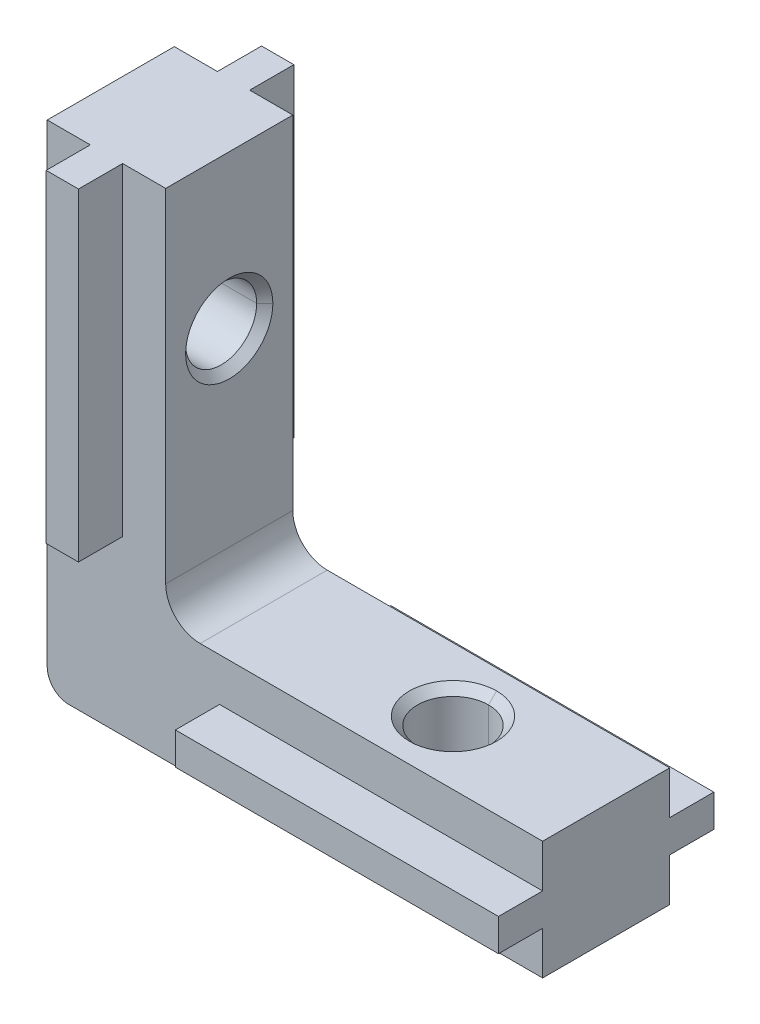
ISO-10303-21;
HEADER;
FILE_DESCRIPTION(('STEP AP214'),'2;1');
FILE_NAME('part.step','',(''),(''),'','','');
FILE_SCHEMA(('AUTOMOTIVE_DESIGN { 1 0 10303 214 1 1 1 1 }'));
ENDSEC;
DATA;
#1=APPLICATION_CONTEXT('core data for automotive mechanical design processes');
#2=APPLICATION_PROTOCOL_DEFINITION('international standard','automotive_design',2000,#1);
#3=PRODUCT_CONTEXT('',#1,'mechanical');
#4=PRODUCT('Part','Part','',(#3));
#5=PRODUCT_RELATED_PRODUCT_CATEGORY('part','',(#4));
#6=PRODUCT_DEFINITION_FORMATION('','',#4);
#7=PRODUCT_DEFINITION_CONTEXT('part definition',#1,'design');
#8=PRODUCT_DEFINITION('design','',#6,#7);
#9=PRODUCT_DEFINITION_SHAPE('','',#8);
#10=(LENGTH_UNIT() NAMED_UNIT(*) SI_UNIT(.MILLI.,.METRE.));
#11=(NAMED_UNIT(*) PLANE_ANGLE_UNIT() SI_UNIT($,.RADIAN.));
#12=(NAMED_UNIT(*) SI_UNIT($,.STERADIAN.) SOLID_ANGLE_UNIT());
#13=UNCERTAINTY_MEASURE_WITH_UNIT(LENGTH_MEASURE(1.E-05),#10,'distance_accuracy_value','');
#14=(GEOMETRIC_REPRESENTATION_CONTEXT(3) GLOBAL_UNCERTAINTY_ASSIGNED_CONTEXT((#13)) GLOBAL_UNIT_ASSIGNED_CONTEXT((#10,
#11,#12)) REPRESENTATION_CONTEXT('',''));
#15=CARTESIAN_POINT('',(0.,0.,0.));
#16=DIRECTION('',(0.,0.,1.));
#17=DIRECTION('',(1.,0.,0.));
#18=AXIS2_PLACEMENT_3D('',#15,#16,#17);
#19=CARTESIAN_POINT('',(15.8889482700318,5.49999999999994,0.));
#20=DIRECTION('',(0.,1.,0.));
#21=DIRECTION('',(0.,0.,1.));
#22=AXIS2_PLACEMENT_3D('',#19,#20,#21);
#23=CONICAL_SURFACE('',#22,2.025,0.785398163397446);
#24=CARTESIAN_POINT('',(15.8889482700318,5.12499999999994,0.));
#25=DIRECTION('',(0.,1.,0.));
#26=DIRECTION('',(0.,0.,1.));
#27=AXIS2_PLACEMENT_3D('',#24,#25,#26);
#28=CIRCLE('',#27,1.65);
#29=CARTESIAN_POINT('',(15.8889482700318,5.12499999999994,-1.65));
#30=VERTEX_POINT('',#29);
#31=CARTESIAN_POINT('',(15.8889482700318,5.12499999999994,1.65));
#32=VERTEX_POINT('',#31);
#33=EDGE_CURVE('E41',#30,#32,#28,.T.);
#34=ORIENTED_EDGE('',*,*,#33,.F.);
#35=DIRECTION('',(0.,0.707106781186549,-0.707106781186546));
#36=VECTOR('',#35,1.);
#37=CARTESIAN_POINT('',(15.8889482700318,5.49999999999994,-2.025));
#38=LINE('',#37,#36);
#39=CARTESIAN_POINT('',(15.8889482700318,5.49999999999994,-2.025));
#40=VERTEX_POINT('',#39);
#41=EDGE_CURVE('E11',#30,#40,#38,.T.);
#42=ORIENTED_EDGE('',*,*,#41,.T.);
#43=CARTESIAN_POINT('',(15.8889482700318,5.49999999999994,0.));
#44=DIRECTION('',(0.,1.,0.));
#45=DIRECTION('',(0.,0.,1.));
#46=AXIS2_PLACEMENT_3D('',#43,#44,#45);
#47=CIRCLE('',#46,2.025);
#48=CARTESIAN_POINT('',(15.8889482700318,5.49999999999994,2.025));
#49=VERTEX_POINT('',#48);
#50=EDGE_CURVE('E27',#40,#49,#47,.T.);
#51=ORIENTED_EDGE('',*,*,#50,.T.);
#52=DIRECTION('',(0.,0.707106781186549,0.707106781186546));
#53=VECTOR('',#52,1.);
#54=CARTESIAN_POINT('',(15.8889482700318,5.49999999999994,2.025));
#55=LINE('',#54,#53);
#56=EDGE_CURVE('E403',#32,#49,#55,.T.);
#57=ORIENTED_EDGE('',*,*,#56,.F.);
#58=EDGE_LOOP('',(#34,#42,#51,#57));
#59=FACE_BOUND('',#58,.T.);
#60=ADVANCED_FACE('F16',(#59),#23,.F.);
#61=CARTESIAN_POINT('',(15.8889482700318,5.49999999999994,0.));
#62=DIRECTION('',(0.,1.,0.));
#63=DIRECTION('',(0.,0.,1.));
#64=AXIS2_PLACEMENT_3D('',#61,#62,#63);
#65=CYLINDRICAL_SURFACE('',#64,1.65);
#66=CARTESIAN_POINT('',(15.8889482700318,0.,0.));
#67=DIRECTION('',(0.,1.,0.));
#68=DIRECTION('',(0.,0.,1.));
#69=AXIS2_PLACEMENT_3D('',#66,#67,#68);
#70=CIRCLE('',#69,1.65);
#71=CARTESIAN_POINT('',(15.8889482700318,0.,-1.65));
#72=VERTEX_POINT('',#71);
#73=CARTESIAN_POINT('',(15.8889482700318,0.,1.65));
#74=VERTEX_POINT('',#73);
#75=EDGE_CURVE('E507',#72,#74,#70,.T.);
#76=ORIENTED_EDGE('',*,*,#75,.F.);
#77=DIRECTION('',(0.,1.,0.));
#78=VECTOR('',#77,1.);
#79=CARTESIAN_POINT('',(15.8889482700318,5.49999999999994,-1.65));
#80=LINE('',#79,#78);
#81=EDGE_CURVE('E366',#72,#30,#80,.T.);
#82=ORIENTED_EDGE('',*,*,#81,.T.);
#83=ORIENTED_EDGE('',*,*,#33,.T.);
#84=DIRECTION('',(0.,1.,0.));
#85=VECTOR('',#84,1.);
#86=CARTESIAN_POINT('',(15.8889482700318,5.49999999999994,1.65));
#87=LINE('',#86,#85);
#88=EDGE_CURVE('E410',#74,#32,#87,.T.);
#89=ORIENTED_EDGE('',*,*,#88,.F.);
#90=EDGE_LOOP('',(#76,#82,#83,#89));
#91=FACE_BOUND('',#90,.T.);
#92=ADVANCED_FACE('F787',(#91),#65,.F.);
#93=CARTESIAN_POINT('',(5.5,15.8889482700318,0.));
#94=DIRECTION('',(1.,0.,0.));
#95=DIRECTION('',(0.,0.,-1.));
#96=AXIS2_PLACEMENT_3D('',#93,#94,#95);
#97=CONICAL_SURFACE('',#96,2.025,0.785398163397446);
#98=CARTESIAN_POINT('',(5.125,15.8889482700318,0.));
#99=DIRECTION('',(1.,0.,0.));
#100=DIRECTION('',(0.,0.,-1.));
#101=AXIS2_PLACEMENT_3D('',#98,#99,#100);
#102=CIRCLE('',#101,1.65);
#103=CARTESIAN_POINT('',(5.125,15.8889482700318,1.65));
#104=VERTEX_POINT('',#103);
#105=CARTESIAN_POINT('',(5.125,15.8889482700318,-1.65));
#106=VERTEX_POINT('',#105);
#107=EDGE_CURVE('E372',#104,#106,#102,.T.);
#108=ORIENTED_EDGE('',*,*,#107,.F.);
#109=DIRECTION('',(0.707106781186549,0.,0.707106781186546));
#110=VECTOR('',#109,1.);
#111=CARTESIAN_POINT('',(5.5,15.8889482700318,2.025));
#112=LINE('',#111,#110);
#113=CARTESIAN_POINT('',(5.5,15.8889482700318,2.025));
#114=VERTEX_POINT('',#113);
#115=EDGE_CURVE('E350',#104,#114,#112,.T.);
#116=ORIENTED_EDGE('',*,*,#115,.T.);
#117=CARTESIAN_POINT('',(5.5,15.8889482700318,0.));
#118=DIRECTION('',(1.,0.,0.));
#119=DIRECTION('',(0.,0.,-1.));
#120=AXIS2_PLACEMENT_3D('',#117,#118,#119);
#121=CIRCLE('',#120,2.025);
#122=CARTESIAN_POINT('',(5.5,15.8889482700318,-2.025));
#123=VERTEX_POINT('',#122);
#124=EDGE_CURVE('E346',#114,#123,#121,.T.);
#125=ORIENTED_EDGE('',*,*,#124,.T.);
#126=DIRECTION('',(0.707106781186549,0.,-0.707106781186546));
#127=VECTOR('',#126,1.);
#128=CARTESIAN_POINT('',(5.5,15.8889482700318,-2.025));
#129=LINE('',#128,#127);
#130=EDGE_CURVE('E515',#106,#123,#129,.T.);
#131=ORIENTED_EDGE('',*,*,#130,.F.);
#132=EDGE_LOOP('',(#108,#116,#125,#131));
#133=FACE_BOUND('',#132,.T.);
#134=ADVANCED_FACE('F792',(#133),#97,.F.);
#135=CARTESIAN_POINT('',(5.5,15.8889482700318,0.));
#136=DIRECTION('',(1.,0.,0.));
#137=DIRECTION('',(0.,0.,-1.));
#138=AXIS2_PLACEMENT_3D('',#135,#136,#137);
#139=CYLINDRICAL_SURFACE('',#138,1.65);
#140=CARTESIAN_POINT('',(0.,15.8889482700318,0.));
#141=DIRECTION('',(1.,0.,0.));
#142=DIRECTION('',(0.,0.,-1.));
#143=AXIS2_PLACEMENT_3D('',#140,#141,#142);
#144=CIRCLE('',#143,1.65);
#145=CARTESIAN_POINT('',(0.,15.8889482700318,1.65));
#146=VERTEX_POINT('',#145);
#147=CARTESIAN_POINT('',(0.,15.8889482700318,-1.65));
#148=VERTEX_POINT('',#147);
#149=EDGE_CURVE('E404',#146,#148,#144,.T.);
#150=ORIENTED_EDGE('',*,*,#149,.F.);
#151=DIRECTION('',(1.,0.,0.));
#152=VECTOR('',#151,1.);
#153=CARTESIAN_POINT('',(5.5,15.8889482700318,1.65));
#154=LINE('',#153,#152);
#155=EDGE_CURVE('E351',#146,#104,#154,.T.);
#156=ORIENTED_EDGE('',*,*,#155,.T.);
#157=ORIENTED_EDGE('',*,*,#107,.T.);
#158=DIRECTION('',(1.,0.,0.));
#159=VECTOR('',#158,1.);
#160=CARTESIAN_POINT('',(5.5,15.8889482700318,-1.65));
#161=LINE('',#160,#159);
#162=EDGE_CURVE('E333',#148,#106,#161,.T.);
#163=ORIENTED_EDGE('',*,*,#162,.F.);
#164=EDGE_LOOP('',(#150,#156,#157,#163));
#165=FACE_BOUND('',#164,.T.);
#166=ADVANCED_FACE('F822',(#165),#139,.F.);
#167=CARTESIAN_POINT('',(0.,0.,2.95));
#168=DIRECTION('',(0.,0.,1.));
#169=DIRECTION('',(1.,0.,0.));
#170=AXIS2_PLACEMENT_3D('',#167,#168,#169);
#171=PLANE('',#170);
#172=DIRECTION('',(0.,-1.,0.));
#173=VECTOR('',#172,1.);
#174=CARTESIAN_POINT('',(0.,23.,2.95));
#175=LINE('',#174,#173);
#176=CARTESIAN_POINT('',(0.,23.,2.95));
#177=VERTEX_POINT('',#176);
#178=CARTESIAN_POINT('',(0.,1.,2.95));
#179=VERTEX_POINT('',#178);
#180=EDGE_CURVE('E369',#177,#179,#175,.T.);
#181=ORIENTED_EDGE('',*,*,#180,.T.);
#182=CARTESIAN_POINT('',(1.,1.,2.95));
#183=DIRECTION('',(0.,0.,1.));
#184=DIRECTION('',(1.,0.,0.));
#185=AXIS2_PLACEMENT_3D('',#182,#183,#184);
#186=CIRCLE('',#185,1.);
#187=CARTESIAN_POINT('',(1.,0.,2.95));
#188=VERTEX_POINT('',#187);
#189=EDGE_CURVE('E373',#179,#188,#186,.T.);
#190=ORIENTED_EDGE('',*,*,#189,.T.);
#191=DIRECTION('',(1.,0.,0.));
#192=VECTOR('',#191,1.);
#193=CARTESIAN_POINT('',(0.,0.,2.95));
#194=LINE('',#193,#192);
#195=CARTESIAN_POINT('',(23.,0.,2.95));
#196=VERTEX_POINT('',#195);
#197=EDGE_CURVE('E429',#188,#196,#194,.T.);
#198=ORIENTED_EDGE('',*,*,#197,.T.);
#199=DIRECTION('',(0.,1.,0.));
#200=VECTOR('',#199,1.);
#201=CARTESIAN_POINT('',(23.,0.,2.95));
#202=LINE('',#201,#200);
#203=CARTESIAN_POINT('',(23.,1.99999999999992,2.95));
#204=VERTEX_POINT('',#203);
#205=EDGE_CURVE('E425',#196,#204,#202,.T.);
#206=ORIENTED_EDGE('',*,*,#205,.T.);
#207=DIRECTION('',(-1.,0.,0.));
#208=VECTOR('',#207,1.);
#209=CARTESIAN_POINT('',(0.,2.,2.95));
#210=LINE('',#209,#208);
#211=CARTESIAN_POINT('',(8.,1.99999999999997,2.95));
#212=VERTEX_POINT('',#211);
#213=EDGE_CURVE('E430',#204,#212,#210,.T.);
#214=ORIENTED_EDGE('',*,*,#213,.T.);
#215=DIRECTION('',(0.,1.,0.));
#216=VECTOR('',#215,1.);
#217=CARTESIAN_POINT('',(8.,0.,2.95));
#218=LINE('',#217,#216);
#219=CARTESIAN_POINT('',(8.,3.5,2.95));
#220=VERTEX_POINT('',#219);
#221=EDGE_CURVE('E496',#212,#220,#218,.T.);
#222=ORIENTED_EDGE('',*,*,#221,.T.);
#223=DIRECTION('',(1.,0.,0.));
#224=VECTOR('',#223,1.);
#225=CARTESIAN_POINT('',(0.,3.5,2.95));
#226=LINE('',#225,#224);
#227=CARTESIAN_POINT('',(23.,3.49999999999992,2.95));
#228=VERTEX_POINT('',#227);
#229=EDGE_CURVE('E326',#220,#228,#226,.T.);
#230=ORIENTED_EDGE('',*,*,#229,.T.);
#231=DIRECTION('',(0.,1.,0.));
#232=VECTOR('',#231,1.);
#233=CARTESIAN_POINT('',(23.,0.,2.95));
#234=LINE('',#233,#232);
#235=CARTESIAN_POINT('',(23.,5.5,2.95));
#236=VERTEX_POINT('',#235);
#237=EDGE_CURVE('E322',#228,#236,#234,.T.);
#238=ORIENTED_EDGE('',*,*,#237,.T.);
#239=DIRECTION('',(-1.,0.,0.));
#240=VECTOR('',#239,1.);
#241=CARTESIAN_POINT('',(23.,5.5,2.95));
#242=LINE('',#241,#240);
#243=CARTESIAN_POINT('',(7.1,5.5,2.95));
#244=VERTEX_POINT('',#243);
#245=EDGE_CURVE('E327',#236,#244,#242,.T.);
#246=ORIENTED_EDGE('',*,*,#245,.T.);
#247=CARTESIAN_POINT('',(7.1,7.1,2.95));
#248=DIRECTION('',(0.,0.,-1.));
#249=DIRECTION('',(1.,0.,0.));
#250=AXIS2_PLACEMENT_3D('',#247,#248,#249);
#251=CIRCLE('',#250,1.6);
#252=CARTESIAN_POINT('',(5.5,7.1,2.95));
#253=VERTEX_POINT('',#252);
#254=EDGE_CURVE('E458',#244,#253,#251,.T.);
#255=ORIENTED_EDGE('',*,*,#254,.T.);
#256=DIRECTION('',(0.,1.,0.));
#257=VECTOR('',#256,1.);
#258=CARTESIAN_POINT('',(5.5,5.5,2.95));
#259=LINE('',#258,#257);
#260=CARTESIAN_POINT('',(5.5,23.,2.95));
#261=VERTEX_POINT('',#260);
#262=EDGE_CURVE('E84',#253,#261,#259,.T.);
#263=ORIENTED_EDGE('',*,*,#262,.T.);
#264=DIRECTION('',(-1.,0.,0.));
#265=VECTOR('',#264,1.);
#266=CARTESIAN_POINT('',(5.5,23.,2.95));
#267=LINE('',#266,#265);
#268=CARTESIAN_POINT('',(3.5,23.,2.95));
#269=VERTEX_POINT('',#268);
#270=EDGE_CURVE('E101',#261,#269,#267,.T.);
#271=ORIENTED_EDGE('',*,*,#270,.T.);
#272=DIRECTION('',(0.,1.,0.));
#273=VECTOR('',#272,1.);
#274=CARTESIAN_POINT('',(3.5,0.,2.95));
#275=LINE('',#274,#273);
#276=CARTESIAN_POINT('',(3.5,8.,2.95));
#277=VERTEX_POINT('',#276);
#278=EDGE_CURVE('E468',#277,#269,#275,.T.);
#279=ORIENTED_EDGE('',*,*,#278,.F.);
#280=DIRECTION('',(-1.,0.,0.));
#281=VECTOR('',#280,1.);
#282=CARTESIAN_POINT('',(0.,8.,2.95));
#283=LINE('',#282,#281);
#284=CARTESIAN_POINT('',(2.,8.,2.95));
#285=VERTEX_POINT('',#284);
#286=EDGE_CURVE('E462',#277,#285,#283,.T.);
#287=ORIENTED_EDGE('',*,*,#286,.T.);
#288=DIRECTION('',(0.,-1.,0.));
#289=VECTOR('',#288,1.);
#290=CARTESIAN_POINT('',(2.,0.,2.95));
#291=LINE('',#290,#289);
#292=CARTESIAN_POINT('',(2.,23.,2.95));
#293=VERTEX_POINT('',#292);
#294=EDGE_CURVE('E321',#293,#285,#291,.T.);
#295=ORIENTED_EDGE('',*,*,#294,.F.);
#296=DIRECTION('',(-1.,0.,0.));
#297=VECTOR('',#296,1.);
#298=CARTESIAN_POINT('',(5.5,23.,2.95));
#299=LINE('',#298,#297);
#300=EDGE_CURVE('E459',#293,#177,#299,.T.);
#301=ORIENTED_EDGE('',*,*,#300,.T.);
#302=EDGE_LOOP('',(#181,#190,#198,#206,#214,#222,#230,#238,#246,#255,#263,#271,#279,#287,#295,#301));
#303=FACE_BOUND('',#302,.T.);
#304=ADVANCED_FACE('F619',(#303),#171,.T.);
#305=CARTESIAN_POINT('',(0.,0.,-2.95));
#306=DIRECTION('',(0.,0.,1.));
#307=DIRECTION('',(1.,0.,0.));
#308=AXIS2_PLACEMENT_3D('',#305,#306,#307);
#309=PLANE('',#308);
#310=DIRECTION('',(1.,0.,0.));
#311=VECTOR('',#310,1.);
#312=CARTESIAN_POINT('',(0.,0.,-2.95));
#313=LINE('',#312,#311);
#314=CARTESIAN_POINT('',(1.,0.,-2.95));
#315=VERTEX_POINT('',#314);
#316=CARTESIAN_POINT('',(23.,0.,-2.95));
#317=VERTEX_POINT('',#316);
#318=EDGE_CURVE('E437',#315,#317,#313,.T.);
#319=ORIENTED_EDGE('',*,*,#318,.F.);
#320=CARTESIAN_POINT('',(1.,1.,-2.95));
#321=DIRECTION('',(0.,0.,-1.));
#322=DIRECTION('',(1.,0.,0.));
#323=AXIS2_PLACEMENT_3D('',#320,#321,#322);
#324=CIRCLE('',#323,1.);
#325=CARTESIAN_POINT('',(0.,1.,-2.95));
#326=VERTEX_POINT('',#325);
#327=EDGE_CURVE('E463',#315,#326,#324,.T.);
#328=ORIENTED_EDGE('',*,*,#327,.T.);
#329=DIRECTION('',(0.,-1.,0.));
#330=VECTOR('',#329,1.);
#331=CARTESIAN_POINT('',(0.,23.,-2.95));
#332=LINE('',#331,#330);
#333=CARTESIAN_POINT('',(0.,23.,-2.95));
#334=VERTEX_POINT('',#333);
#335=EDGE_CURVE('E435',#334,#326,#332,.T.);
#336=ORIENTED_EDGE('',*,*,#335,.F.);
#337=DIRECTION('',(-1.,0.,0.));
#338=VECTOR('',#337,1.);
#339=CARTESIAN_POINT('',(5.5,23.,-2.95));
#340=LINE('',#339,#338);
#341=CARTESIAN_POINT('',(2.,23.,-2.95));
#342=VERTEX_POINT('',#341);
#343=EDGE_CURVE('E557',#342,#334,#340,.T.);
#344=ORIENTED_EDGE('',*,*,#343,.F.);
#345=DIRECTION('',(0.,-1.,0.));
#346=VECTOR('',#345,1.);
#347=CARTESIAN_POINT('',(2.,0.,-2.95));
#348=LINE('',#347,#346);
#349=CARTESIAN_POINT('',(2.,8.,-2.95));
#350=VERTEX_POINT('',#349);
#351=EDGE_CURVE('E285',#342,#350,#348,.T.);
#352=ORIENTED_EDGE('',*,*,#351,.T.);
#353=DIRECTION('',(-1.,0.,0.));
#354=VECTOR('',#353,1.);
#355=CARTESIAN_POINT('',(0.,8.,-2.95));
#356=LINE('',#355,#354);
#357=CARTESIAN_POINT('',(3.5,8.,-2.95));
#358=VERTEX_POINT('',#357);
#359=EDGE_CURVE('E277',#358,#350,#356,.T.);
#360=ORIENTED_EDGE('',*,*,#359,.F.);
#361=DIRECTION('',(0.,1.,0.));
#362=VECTOR('',#361,1.);
#363=CARTESIAN_POINT('',(3.5,0.,-2.95));
#364=LINE('',#363,#362);
#365=CARTESIAN_POINT('',(3.5,23.,-2.95));
#366=VERTEX_POINT('',#365);
#367=EDGE_CURVE('E282',#358,#366,#364,.T.);
#368=ORIENTED_EDGE('',*,*,#367,.T.);
#369=DIRECTION('',(-1.,0.,0.));
#370=VECTOR('',#369,1.);
#371=CARTESIAN_POINT('',(5.5,23.,-2.95));
#372=LINE('',#371,#370);
#373=CARTESIAN_POINT('',(5.5,23.,-2.95));
#374=VERTEX_POINT('',#373);
#375=EDGE_CURVE('E375',#374,#366,#372,.T.);
#376=ORIENTED_EDGE('',*,*,#375,.F.);
#377=DIRECTION('',(0.,1.,0.));
#378=VECTOR('',#377,1.);
#379=CARTESIAN_POINT('',(5.5,5.5,-2.95));
#380=LINE('',#379,#378);
#381=CARTESIAN_POINT('',(5.5,7.1,-2.95));
#382=VERTEX_POINT('',#381);
#383=EDGE_CURVE('E336',#382,#374,#380,.T.);
#384=ORIENTED_EDGE('',*,*,#383,.F.);
#385=CARTESIAN_POINT('',(7.1,7.1,-2.95));
#386=DIRECTION('',(0.,0.,1.));
#387=DIRECTION('',(1.,0.,0.));
#388=AXIS2_PLACEMENT_3D('',#385,#386,#387);
#389=CIRCLE('',#388,1.6);
#390=CARTESIAN_POINT('',(7.1,5.5,-2.95));
#391=VERTEX_POINT('',#390);
#392=EDGE_CURVE('E20',#382,#391,#389,.T.);
#393=ORIENTED_EDGE('',*,*,#392,.T.);
#394=DIRECTION('',(-1.,0.,0.));
#395=VECTOR('',#394,1.);
#396=CARTESIAN_POINT('',(23.,5.5,-2.95));
#397=LINE('',#396,#395);
#398=CARTESIAN_POINT('',(23.,5.5,-2.95));
#399=VERTEX_POINT('',#398);
#400=EDGE_CURVE('E135',#399,#391,#397,.T.);
#401=ORIENTED_EDGE('',*,*,#400,.F.);
#402=DIRECTION('',(0.,1.,0.));
#403=VECTOR('',#402,1.);
#404=CARTESIAN_POINT('',(23.,0.,-2.95));
#405=LINE('',#404,#403);
#406=CARTESIAN_POINT('',(23.,3.49999999999992,-2.95));
#407=VERTEX_POINT('',#406);
#408=EDGE_CURVE('E504',#407,#399,#405,.T.);
#409=ORIENTED_EDGE('',*,*,#408,.F.);
#410=DIRECTION('',(1.,0.,0.));
#411=VECTOR('',#410,1.);
#412=CARTESIAN_POINT('',(0.,3.5,-2.95));
#413=LINE('',#412,#411);
#414=CARTESIAN_POINT('',(8.,3.5,-2.95));
#415=VERTEX_POINT('',#414);
#416=EDGE_CURVE('E122',#415,#407,#413,.T.);
#417=ORIENTED_EDGE('',*,*,#416,.F.);
#418=DIRECTION('',(0.,1.,0.));
#419=VECTOR('',#418,1.);
#420=CARTESIAN_POINT('',(8.,0.,-2.95));
#421=LINE('',#420,#419);
#422=CARTESIAN_POINT('',(8.,1.99999999999997,-2.95));
#423=VERTEX_POINT('',#422);
#424=EDGE_CURVE('E357',#423,#415,#421,.T.);
#425=ORIENTED_EDGE('',*,*,#424,.F.);
#426=DIRECTION('',(-1.,0.,0.));
#427=VECTOR('',#426,1.);
#428=CARTESIAN_POINT('',(0.,2.,-2.95));
#429=LINE('',#428,#427);
#430=CARTESIAN_POINT('',(23.,1.99999999999992,-2.95));
#431=VERTEX_POINT('',#430);
#432=EDGE_CURVE('E446',#431,#423,#429,.T.);
#433=ORIENTED_EDGE('',*,*,#432,.F.);
#434=DIRECTION('',(0.,1.,0.));
#435=VECTOR('',#434,1.);
#436=CARTESIAN_POINT('',(23.,0.,-2.95));
#437=LINE('',#436,#435);
#438=EDGE_CURVE('E424',#317,#431,#437,.T.);
#439=ORIENTED_EDGE('',*,*,#438,.F.);
#440=EDGE_LOOP('',(#319,#328,#336,#344,#352,#360,#368,#376,#384,#393,#401,#409,#417,#425,#433,#439));
#441=FACE_BOUND('',#440,.T.);
#442=ADVANCED_FACE('F280',(#441),#309,.F.);
#443=CARTESIAN_POINT('',(5.5,23.,2.95));
#444=DIRECTION('',(0.,-1.,0.));
#445=DIRECTION('',(0.,0.,-1.));
#446=AXIS2_PLACEMENT_3D('',#443,#444,#445);
#447=PLANE('',#446);
#448=ORIENTED_EDGE('',*,*,#375,.T.);
#449=DIRECTION('',(0.,0.,-1.));
#450=VECTOR('',#449,1.);
#451=CARTESIAN_POINT('',(3.5,23.,5.));
#452=LINE('',#451,#450);
#453=CARTESIAN_POINT('',(3.5,23.,-5.));
#454=VERTEX_POINT('',#453);
#455=EDGE_CURVE('E299',#366,#454,#452,.T.);
#456=ORIENTED_EDGE('',*,*,#455,.T.);
#457=DIRECTION('',(-1.,0.,0.));
#458=VECTOR('',#457,1.);
#459=CARTESIAN_POINT('',(3.5,23.,-5.));
#460=LINE('',#459,#458);
#461=CARTESIAN_POINT('',(2.,23.,-5.));
#462=VERTEX_POINT('',#461);
#463=EDGE_CURVE('E485',#454,#462,#460,.T.);
#464=ORIENTED_EDGE('',*,*,#463,.T.);
#465=DIRECTION('',(0.,0.,1.));
#466=VECTOR('',#465,1.);
#467=CARTESIAN_POINT('',(2.,23.,5.));
#468=LINE('',#467,#466);
#469=EDGE_CURVE('E553',#462,#342,#468,.T.);
#470=ORIENTED_EDGE('',*,*,#469,.T.);
#471=ORIENTED_EDGE('',*,*,#343,.T.);
#472=DIRECTION('',(0.,0.,-1.));
#473=VECTOR('',#472,1.);
#474=CARTESIAN_POINT('',(0.,23.,2.95));
#475=LINE('',#474,#473);
#476=EDGE_CURVE('E436',#177,#334,#475,.T.);
#477=ORIENTED_EDGE('',*,*,#476,.F.);
#478=ORIENTED_EDGE('',*,*,#300,.F.);
#479=DIRECTION('',(0.,0.,1.));
#480=VECTOR('',#479,1.);
#481=CARTESIAN_POINT('',(2.,23.,5.));
#482=LINE('',#481,#480);
#483=CARTESIAN_POINT('',(2.,23.,5.));
#484=VERTEX_POINT('',#483);
#485=EDGE_CURVE('E397',#293,#484,#482,.T.);
#486=ORIENTED_EDGE('',*,*,#485,.T.);
#487=DIRECTION('',(1.,0.,0.));
#488=VECTOR('',#487,1.);
#489=CARTESIAN_POINT('',(3.5,23.,5.));
#490=LINE('',#489,#488);
#491=CARTESIAN_POINT('',(3.5,23.,5.));
#492=VERTEX_POINT('',#491);
#493=EDGE_CURVE('E393',#484,#492,#490,.T.);
#494=ORIENTED_EDGE('',*,*,#493,.T.);
#495=DIRECTION('',(0.,0.,-1.));
#496=VECTOR('',#495,1.);
#497=CARTESIAN_POINT('',(3.5,23.,5.));
#498=LINE('',#497,#496);
#499=EDGE_CURVE('E398',#492,#269,#498,.T.);
#500=ORIENTED_EDGE('',*,*,#499,.T.);
#501=ORIENTED_EDGE('',*,*,#270,.F.);
#502=DIRECTION('',(0.,0.,-1.));
#503=VECTOR('',#502,1.);
#504=CARTESIAN_POINT('',(5.5,23.,2.95));
#505=LINE('',#504,#503);
#506=EDGE_CURVE('E418',#261,#374,#505,.T.);
#507=ORIENTED_EDGE('',*,*,#506,.T.);
#508=EDGE_LOOP('',(#448,#456,#464,#470,#471,#477,#478,#486,#494,#500,#501,#507));
#509=FACE_BOUND('',#508,.T.);
#510=ADVANCED_FACE('F620',(#509),#447,.F.);
#511=CARTESIAN_POINT('',(0.,23.,2.95));
#512=DIRECTION('',(1.,0.,0.));
#513=DIRECTION('',(0.,1.,0.));
#514=AXIS2_PLACEMENT_3D('',#511,#512,#513);
#515=PLANE('',#514);
#516=ORIENTED_EDGE('',*,*,#335,.T.);
#517=DIRECTION('',(0.,0.,1.));
#518=VECTOR('',#517,1.);
#519=CARTESIAN_POINT('',(0.,1.,2.95));
#520=LINE('',#519,#518);
#521=EDGE_CURVE('E431',#326,#179,#520,.T.);
#522=ORIENTED_EDGE('',*,*,#521,.T.);
#523=ORIENTED_EDGE('',*,*,#180,.F.);
#524=ORIENTED_EDGE('',*,*,#476,.T.);
#525=EDGE_LOOP('',(#516,#522,#523,#524));
#526=FACE_BOUND('',#525,.T.);
#527=CARTESIAN_POINT('',(0.,15.8889482700318,0.));
#528=DIRECTION('',(1.,0.,0.));
#529=DIRECTION('',(0.,0.,-1.));
#530=AXIS2_PLACEMENT_3D('',#527,#528,#529);
#531=CIRCLE('',#530,1.65);
#532=EDGE_CURVE('E408',#148,#146,#531,.T.);
#533=ORIENTED_EDGE('',*,*,#532,.T.);
#534=ORIENTED_EDGE('',*,*,#149,.T.);
#535=EDGE_LOOP('',(#533,#534));
#536=FACE_BOUND('',#535,.T.);
#537=ADVANCED_FACE('F859',(#526,#536),#515,.F.);
#538=CARTESIAN_POINT('',(0.,0.,2.95));
#539=DIRECTION('',(0.,1.,0.));
#540=DIRECTION('',(1.,0.,0.));
#541=AXIS2_PLACEMENT_3D('',#538,#539,#540);
#542=PLANE('',#541);
#543=ORIENTED_EDGE('',*,*,#197,.F.);
#544=DIRECTION('',(0.,0.,-1.));
#545=VECTOR('',#544,1.);
#546=CARTESIAN_POINT('',(1.,0.,2.95));
#547=LINE('',#546,#545);
#548=EDGE_CURVE('E409',#188,#315,#547,.T.);
#549=ORIENTED_EDGE('',*,*,#548,.T.);
#550=ORIENTED_EDGE('',*,*,#318,.T.);
#551=DIRECTION('',(0.,0.,-1.));
#552=VECTOR('',#551,1.);
#553=CARTESIAN_POINT('',(23.,0.,2.95));
#554=LINE('',#553,#552);
#555=EDGE_CURVE('E508',#196,#317,#554,.T.);
#556=ORIENTED_EDGE('',*,*,#555,.F.);
#557=EDGE_LOOP('',(#543,#549,#550,#556));
#558=FACE_BOUND('',#557,.T.);
#559=CARTESIAN_POINT('',(15.8889482700318,0.,0.));
#560=DIRECTION('',(0.,1.,0.));
#561=DIRECTION('',(0.,0.,1.));
#562=AXIS2_PLACEMENT_3D('',#559,#560,#561);
#563=CIRCLE('',#562,1.65);
#564=EDGE_CURVE('E440',#74,#72,#563,.T.);
#565=ORIENTED_EDGE('',*,*,#564,.T.);
#566=ORIENTED_EDGE('',*,*,#75,.T.);
#567=EDGE_LOOP('',(#565,#566));
#568=FACE_BOUND('',#567,.T.);
#569=ADVANCED_FACE('F854',(#558,#568),#542,.F.);
#570=CARTESIAN_POINT('',(23.,0.,2.95));
#571=DIRECTION('',(-1.,0.,0.));
#572=DIRECTION('',(0.,0.,1.));
#573=AXIS2_PLACEMENT_3D('',#570,#571,#572);
#574=PLANE('',#573);
#575=DIRECTION('',(0.,0.,-1.));
#576=VECTOR('',#575,1.);
#577=CARTESIAN_POINT('',(23.,3.49999999999992,5.));
#578=LINE('',#577,#576);
#579=CARTESIAN_POINT('',(23.,3.49999999999992,-5.));
#580=VERTEX_POINT('',#579);
#581=EDGE_CURVE('E381',#407,#580,#578,.T.);
#582=ORIENTED_EDGE('',*,*,#581,.F.);
#583=ORIENTED_EDGE('',*,*,#408,.T.);
#584=DIRECTION('',(0.,0.,-1.));
#585=VECTOR('',#584,1.);
#586=CARTESIAN_POINT('',(23.,5.5,2.95));
#587=LINE('',#586,#585);
#588=EDGE_CURVE('E352',#236,#399,#587,.T.);
#589=ORIENTED_EDGE('',*,*,#588,.F.);
#590=ORIENTED_EDGE('',*,*,#237,.F.);
#591=DIRECTION('',(0.,0.,-1.));
#592=VECTOR('',#591,1.);
#593=CARTESIAN_POINT('',(23.,3.49999999999992,5.));
#594=LINE('',#593,#592);
#595=CARTESIAN_POINT('',(23.,3.49999999999992,5.));
#596=VERTEX_POINT('',#595);
#597=EDGE_CURVE('E340',#596,#228,#594,.T.);
#598=ORIENTED_EDGE('',*,*,#597,.F.);
#599=DIRECTION('',(0.,1.,0.));
#600=VECTOR('',#599,1.);
#601=CARTESIAN_POINT('',(23.,3.49999999999992,5.));
#602=LINE('',#601,#600);
#603=CARTESIAN_POINT('',(23.,1.99999999999992,5.));
#604=VERTEX_POINT('',#603);
#605=EDGE_CURVE('E471',#604,#596,#602,.T.);
#606=ORIENTED_EDGE('',*,*,#605,.F.);
#607=DIRECTION('',(0.,0.,1.));
#608=VECTOR('',#607,1.);
#609=CARTESIAN_POINT('',(23.,1.99999999999992,5.));
#610=LINE('',#609,#608);
#611=EDGE_CURVE('E475',#204,#604,#610,.T.);
#612=ORIENTED_EDGE('',*,*,#611,.F.);
#613=ORIENTED_EDGE('',*,*,#205,.F.);
#614=ORIENTED_EDGE('',*,*,#555,.T.);
#615=ORIENTED_EDGE('',*,*,#438,.T.);
#616=DIRECTION('',(0.,0.,1.));
#617=VECTOR('',#616,1.);
#618=CARTESIAN_POINT('',(23.,1.99999999999992,5.));
#619=LINE('',#618,#617);
#620=CARTESIAN_POINT('',(23.,1.99999999999992,-5.));
#621=VERTEX_POINT('',#620);
#622=EDGE_CURVE('E442',#621,#431,#619,.T.);
#623=ORIENTED_EDGE('',*,*,#622,.F.);
#624=DIRECTION('',(0.,-1.,0.));
#625=VECTOR('',#624,1.);
#626=CARTESIAN_POINT('',(23.,3.49999999999992,-5.));
#627=LINE('',#626,#625);
#628=EDGE_CURVE('E450',#580,#621,#627,.T.);
#629=ORIENTED_EDGE('',*,*,#628,.F.);
#630=EDGE_LOOP('',(#582,#583,#589,#590,#598,#606,#612,#613,#614,#615,#623,#629));
#631=FACE_BOUND('',#630,.T.);
#632=ADVANCED_FACE('F658',(#631),#574,.F.);
#633=CARTESIAN_POINT('',(23.,5.5,2.95));
#634=DIRECTION('',(0.,-1.,0.));
#635=DIRECTION('',(0.,0.,-1.));
#636=AXIS2_PLACEMENT_3D('',#633,#634,#635);
#637=PLANE('',#636);
#638=ORIENTED_EDGE('',*,*,#400,.T.);
#639=DIRECTION('',(0.,0.,1.));
#640=VECTOR('',#639,1.);
#641=CARTESIAN_POINT('',(7.1,5.5,2.95));
#642=LINE('',#641,#640);
#643=EDGE_CURVE('E317',#391,#244,#642,.T.);
#644=ORIENTED_EDGE('',*,*,#643,.T.);
#645=ORIENTED_EDGE('',*,*,#245,.F.);
#646=ORIENTED_EDGE('',*,*,#588,.T.);
#647=EDGE_LOOP('',(#638,#644,#645,#646));
#648=FACE_BOUND('',#647,.T.);
#649=CARTESIAN_POINT('',(15.8889482700318,5.49999999999994,0.));
#650=DIRECTION('',(0.,1.,0.));
#651=DIRECTION('',(0.,0.,1.));
#652=AXIS2_PLACEMENT_3D('',#649,#650,#651);
#653=CIRCLE('',#652,2.025);
#654=EDGE_CURVE('E399',#49,#40,#653,.T.);
#655=ORIENTED_EDGE('',*,*,#654,.F.);
#656=ORIENTED_EDGE('',*,*,#50,.F.);
#657=EDGE_LOOP('',(#655,#656));
#658=FACE_BOUND('',#657,.T.);
#659=ADVANCED_FACE('F1049',(#648,#658),#637,.F.);
#660=CARTESIAN_POINT('',(5.5,5.5,2.95));
#661=DIRECTION('',(-1.,0.,0.));
#662=DIRECTION('',(0.,0.,1.));
#663=AXIS2_PLACEMENT_3D('',#660,#661,#662);
#664=PLANE('',#663);
#665=ORIENTED_EDGE('',*,*,#262,.F.);
#666=DIRECTION('',(0.,0.,-1.));
#667=VECTOR('',#666,1.);
#668=CARTESIAN_POINT('',(5.5,7.1,-2.95));
#669=LINE('',#668,#667);
#670=EDGE_CURVE('E356',#253,#382,#669,.T.);
#671=ORIENTED_EDGE('',*,*,#670,.T.);
#672=ORIENTED_EDGE('',*,*,#383,.T.);
#673=ORIENTED_EDGE('',*,*,#506,.F.);
#674=EDGE_LOOP('',(#665,#671,#672,#673));
#675=FACE_BOUND('',#674,.T.);
#676=CARTESIAN_POINT('',(5.5,15.8889482700318,0.));
#677=DIRECTION('',(1.,0.,0.));
#678=DIRECTION('',(0.,0.,-1.));
#679=AXIS2_PLACEMENT_3D('',#676,#677,#678);
#680=CIRCLE('',#679,2.025);
#681=EDGE_CURVE('E454',#123,#114,#680,.T.);
#682=ORIENTED_EDGE('',*,*,#681,.F.);
#683=ORIENTED_EDGE('',*,*,#124,.F.);
#684=EDGE_LOOP('',(#682,#683));
#685=FACE_BOUND('',#684,.T.);
#686=ADVANCED_FACE('F1044',(#675,#685),#664,.F.);
#687=CARTESIAN_POINT('',(3.5,8.,-5.));
#688=DIRECTION('',(0.,0.,-1.));
#689=DIRECTION('',(-1.,0.,0.));
#690=AXIS2_PLACEMENT_3D('',#687,#688,#689);
#691=PLANE('',#690);
#692=ORIENTED_EDGE('',*,*,#463,.F.);
#693=DIRECTION('',(0.,1.,0.));
#694=VECTOR('',#693,1.);
#695=CARTESIAN_POINT('',(3.5,8.,-5.));
#696=LINE('',#695,#694);
#697=CARTESIAN_POINT('',(3.5,8.,-5.));
#698=VERTEX_POINT('',#697);
#699=EDGE_CURVE('E307',#698,#454,#696,.T.);
#700=ORIENTED_EDGE('',*,*,#699,.F.);
#701=DIRECTION('',(-1.,0.,0.));
#702=VECTOR('',#701,1.);
#703=CARTESIAN_POINT('',(3.5,8.,-5.));
#704=LINE('',#703,#702);
#705=CARTESIAN_POINT('',(2.,8.,-5.));
#706=VERTEX_POINT('',#705);
#707=EDGE_CURVE('E305',#698,#706,#704,.T.);
#708=ORIENTED_EDGE('',*,*,#707,.T.);
#709=DIRECTION('',(0.,1.,0.));
#710=VECTOR('',#709,1.);
#711=CARTESIAN_POINT('',(2.,8.,-5.));
#712=LINE('',#711,#710);
#713=EDGE_CURVE('E291',#706,#462,#712,.T.);
#714=ORIENTED_EDGE('',*,*,#713,.T.);
#715=EDGE_LOOP('',(#692,#700,#708,#714));
#716=FACE_BOUND('',#715,.T.);
#717=ADVANCED_FACE('F930',(#716),#691,.T.);
#718=CARTESIAN_POINT('',(0.,8.,0.));
#719=DIRECTION('',(0.,1.,0.));
#720=DIRECTION('',(1.,0.,0.));
#721=AXIS2_PLACEMENT_3D('',#718,#719,#720);
#722=PLANE('',#721);
#723=DIRECTION('',(0.,0.,-1.));
#724=VECTOR('',#723,1.);
#725=CARTESIAN_POINT('',(3.5,8.,5.));
#726=LINE('',#725,#724);
#727=EDGE_CURVE('E292',#358,#698,#726,.T.);
#728=ORIENTED_EDGE('',*,*,#727,.F.);
#729=ORIENTED_EDGE('',*,*,#359,.T.);
#730=DIRECTION('',(0.,0.,1.));
#731=VECTOR('',#730,1.);
#732=CARTESIAN_POINT('',(2.,8.,5.));
#733=LINE('',#732,#731);
#734=EDGE_CURVE('E313',#706,#350,#733,.T.);
#735=ORIENTED_EDGE('',*,*,#734,.F.);
#736=ORIENTED_EDGE('',*,*,#707,.F.);
#737=EDGE_LOOP('',(#728,#729,#735,#736));
#738=FACE_BOUND('',#737,.T.);
#739=ADVANCED_FACE('F303',(#738),#722,.F.);
#740=CARTESIAN_POINT('',(3.5,8.,5.));
#741=DIRECTION('',(1.,0.,0.));
#742=DIRECTION('',(0.,1.,0.));
#743=AXIS2_PLACEMENT_3D('',#740,#741,#742);
#744=PLANE('',#743);
#745=ORIENTED_EDGE('',*,*,#367,.F.);
#746=ORIENTED_EDGE('',*,*,#727,.T.);
#747=ORIENTED_EDGE('',*,*,#699,.T.);
#748=ORIENTED_EDGE('',*,*,#455,.F.);
#749=EDGE_LOOP('',(#745,#746,#747,#748));
#750=FACE_BOUND('',#749,.T.);
#751=ADVANCED_FACE('F296',(#750),#744,.T.);
#752=CARTESIAN_POINT('',(2.,8.,5.));
#753=DIRECTION('',(-1.,0.,0.));
#754=DIRECTION('',(0.,0.,1.));
#755=AXIS2_PLACEMENT_3D('',#752,#753,#754);
#756=PLANE('',#755);
#757=ORIENTED_EDGE('',*,*,#351,.F.);
#758=ORIENTED_EDGE('',*,*,#469,.F.);
#759=ORIENTED_EDGE('',*,*,#713,.F.);
#760=ORIENTED_EDGE('',*,*,#734,.T.);
#761=EDGE_LOOP('',(#757,#758,#759,#760));
#762=FACE_BOUND('',#761,.T.);
#763=ADVANCED_FACE('F808',(#762),#756,.T.);
#764=CARTESIAN_POINT('',(2.,8.,5.));
#765=DIRECTION('',(-1.,0.,0.));
#766=DIRECTION('',(0.,0.,1.));
#767=AXIS2_PLACEMENT_3D('',#764,#765,#766);
#768=PLANE('',#767);
#769=ORIENTED_EDGE('',*,*,#485,.F.);
#770=ORIENTED_EDGE('',*,*,#294,.T.);
#771=DIRECTION('',(0.,0.,1.));
#772=VECTOR('',#771,1.);
#773=CARTESIAN_POINT('',(2.,8.,5.));
#774=LINE('',#773,#772);
#775=CARTESIAN_POINT('',(2.,8.,5.));
#776=VERTEX_POINT('',#775);
#777=EDGE_CURVE('E385',#285,#776,#774,.T.);
#778=ORIENTED_EDGE('',*,*,#777,.T.);
#779=DIRECTION('',(0.,1.,0.));
#780=VECTOR('',#779,1.);
#781=CARTESIAN_POINT('',(2.,8.,5.));
#782=LINE('',#781,#780);
#783=EDGE_CURVE('E392',#776,#484,#782,.T.);
#784=ORIENTED_EDGE('',*,*,#783,.T.);
#785=EDGE_LOOP('',(#769,#770,#778,#784));
#786=FACE_BOUND('',#785,.T.);
#787=ADVANCED_FACE('F803',(#786),#768,.T.);
#788=CARTESIAN_POINT('',(3.5,8.,5.));
#789=DIRECTION('',(1.,0.,0.));
#790=DIRECTION('',(0.,1.,0.));
#791=AXIS2_PLACEMENT_3D('',#788,#789,#790);
#792=PLANE('',#791);
#793=DIRECTION('',(0.,0.,-1.));
#794=VECTOR('',#793,1.);
#795=CARTESIAN_POINT('',(3.5,8.,5.));
#796=LINE('',#795,#794);
#797=CARTESIAN_POINT('',(3.5,8.,5.));
#798=VERTEX_POINT('',#797);
#799=EDGE_CURVE('E464',#798,#277,#796,.T.);
#800=ORIENTED_EDGE('',*,*,#799,.T.);
#801=ORIENTED_EDGE('',*,*,#278,.T.);
#802=ORIENTED_EDGE('',*,*,#499,.F.);
#803=DIRECTION('',(0.,1.,0.));
#804=VECTOR('',#803,1.);
#805=CARTESIAN_POINT('',(3.5,8.,5.));
#806=LINE('',#805,#804);
#807=EDGE_CURVE('E328',#798,#492,#806,.T.);
#808=ORIENTED_EDGE('',*,*,#807,.F.);
#809=EDGE_LOOP('',(#800,#801,#802,#808));
#810=FACE_BOUND('',#809,.T.);
#811=ADVANCED_FACE('F614',(#810),#792,.T.);
#812=CARTESIAN_POINT('',(3.5,8.,5.));
#813=DIRECTION('',(0.,0.,1.));
#814=DIRECTION('',(1.,0.,0.));
#815=AXIS2_PLACEMENT_3D('',#812,#813,#814);
#816=PLANE('',#815);
#817=ORIENTED_EDGE('',*,*,#493,.F.);
#818=ORIENTED_EDGE('',*,*,#783,.F.);
#819=DIRECTION('',(1.,0.,0.));
#820=VECTOR('',#819,1.);
#821=CARTESIAN_POINT('',(3.5,8.,5.));
#822=LINE('',#821,#820);
#823=EDGE_CURVE('E332',#776,#798,#822,.T.);
#824=ORIENTED_EDGE('',*,*,#823,.T.);
#825=ORIENTED_EDGE('',*,*,#807,.T.);
#826=EDGE_LOOP('',(#817,#818,#824,#825));
#827=FACE_BOUND('',#826,.T.);
#828=ADVANCED_FACE('F624',(#827),#816,.T.);
#829=CARTESIAN_POINT('',(0.,8.,0.));
#830=DIRECTION('',(0.,1.,0.));
#831=DIRECTION('',(1.,0.,0.));
#832=AXIS2_PLACEMENT_3D('',#829,#830,#831);
#833=PLANE('',#832);
#834=ORIENTED_EDGE('',*,*,#286,.F.);
#835=ORIENTED_EDGE('',*,*,#799,.F.);
#836=ORIENTED_EDGE('',*,*,#823,.F.);
#837=ORIENTED_EDGE('',*,*,#777,.F.);
#838=EDGE_LOOP('',(#834,#835,#836,#837));
#839=FACE_BOUND('',#838,.T.);
#840=ADVANCED_FACE('F627',(#839),#833,.F.);
#841=CARTESIAN_POINT('',(5.5,15.8889482700318,0.));
#842=DIRECTION('',(1.,0.,0.));
#843=DIRECTION('',(0.,0.,-1.));
#844=AXIS2_PLACEMENT_3D('',#841,#842,#843);
#845=CYLINDRICAL_SURFACE('',#844,1.65);
#846=ORIENTED_EDGE('',*,*,#155,.F.);
#847=ORIENTED_EDGE('',*,*,#532,.F.);
#848=ORIENTED_EDGE('',*,*,#162,.T.);
#849=CARTESIAN_POINT('',(5.125,15.8889482700318,0.));
#850=DIRECTION('',(1.,0.,0.));
#851=DIRECTION('',(0.,0.,-1.));
#852=AXIS2_PLACEMENT_3D('',#849,#850,#851);
#853=CIRCLE('',#852,1.65);
#854=EDGE_CURVE('E492',#106,#104,#853,.T.);
#855=ORIENTED_EDGE('',*,*,#854,.T.);
#856=EDGE_LOOP('',(#846,#847,#848,#855));
#857=FACE_BOUND('',#856,.T.);
#858=ADVANCED_FACE('F912',(#857),#845,.F.);
#859=CARTESIAN_POINT('',(5.5,15.8889482700318,0.));
#860=DIRECTION('',(1.,0.,0.));
#861=DIRECTION('',(0.,0.,-1.));
#862=AXIS2_PLACEMENT_3D('',#859,#860,#861);
#863=CONICAL_SURFACE('',#862,2.025,0.785398163397446);
#864=ORIENTED_EDGE('',*,*,#115,.F.);
#865=ORIENTED_EDGE('',*,*,#854,.F.);
#866=ORIENTED_EDGE('',*,*,#130,.T.);
#867=ORIENTED_EDGE('',*,*,#681,.T.);
#868=EDGE_LOOP('',(#864,#865,#866,#867));
#869=FACE_BOUND('',#868,.T.);
#870=ADVANCED_FACE('F18',(#869),#863,.F.);
#871=CARTESIAN_POINT('',(8.,3.5,-5.));
#872=DIRECTION('',(0.,0.,1.));
#873=DIRECTION('',(1.,0.,0.));
#874=AXIS2_PLACEMENT_3D('',#871,#872,#873);
#875=PLANE('',#874);
#876=ORIENTED_EDGE('',*,*,#628,.T.);
#877=DIRECTION('',(1.,0.,0.));
#878=VECTOR('',#877,1.);
#879=CARTESIAN_POINT('',(8.,1.99999999999997,-5.));
#880=LINE('',#879,#878);
#881=CARTESIAN_POINT('',(8.,1.99999999999997,-5.));
#882=VERTEX_POINT('',#881);
#883=EDGE_CURVE('E449',#882,#621,#880,.T.);
#884=ORIENTED_EDGE('',*,*,#883,.F.);
#885=DIRECTION('',(0.,-1.,0.));
#886=VECTOR('',#885,1.);
#887=CARTESIAN_POINT('',(8.,3.5,-5.));
#888=LINE('',#887,#886);
#889=CARTESIAN_POINT('',(8.,3.5,-5.));
#890=VERTEX_POINT('',#889);
#891=EDGE_CURVE('E380',#890,#882,#888,.T.);
#892=ORIENTED_EDGE('',*,*,#891,.F.);
#893=DIRECTION('',(1.,0.,0.));
#894=VECTOR('',#893,1.);
#895=CARTESIAN_POINT('',(8.,3.5,-5.));
#896=LINE('',#895,#894);
#897=EDGE_CURVE('E455',#890,#580,#896,.T.);
#898=ORIENTED_EDGE('',*,*,#897,.T.);
#899=EDGE_LOOP('',(#876,#884,#892,#898));
#900=FACE_BOUND('',#899,.T.);
#901=ADVANCED_FACE('F666',(#900),#875,.F.);
#902=CARTESIAN_POINT('',(8.,0.,0.));
#903=DIRECTION('',(1.,0.,0.));
#904=DIRECTION('',(0.,0.,1.));
#905=AXIS2_PLACEMENT_3D('',#902,#903,#904);
#906=PLANE('',#905);
#907=DIRECTION('',(0.,0.,1.));
#908=VECTOR('',#907,1.);
#909=CARTESIAN_POINT('',(8.,1.99999999999997,5.));
#910=LINE('',#909,#908);
#911=EDGE_CURVE('E361',#882,#423,#910,.T.);
#912=ORIENTED_EDGE('',*,*,#911,.T.);
#913=ORIENTED_EDGE('',*,*,#424,.T.);
#914=DIRECTION('',(0.,0.,-1.));
#915=VECTOR('',#914,1.);
#916=CARTESIAN_POINT('',(8.,3.5,5.));
#917=LINE('',#916,#915);
#918=EDGE_CURVE('E362',#415,#890,#917,.T.);
#919=ORIENTED_EDGE('',*,*,#918,.T.);
#920=ORIENTED_EDGE('',*,*,#891,.T.);
#921=EDGE_LOOP('',(#912,#913,#919,#920));
#922=FACE_BOUND('',#921,.T.);
#923=ADVANCED_FACE('F669',(#922),#906,.F.);
#924=CARTESIAN_POINT('',(8.,3.5,5.));
#925=DIRECTION('',(0.,-1.,0.));
#926=DIRECTION('',(-1.,0.,0.));
#927=AXIS2_PLACEMENT_3D('',#924,#925,#926);
#928=PLANE('',#927);
#929=ORIENTED_EDGE('',*,*,#918,.F.);
#930=ORIENTED_EDGE('',*,*,#416,.T.);
#931=ORIENTED_EDGE('',*,*,#581,.T.);
#932=ORIENTED_EDGE('',*,*,#897,.F.);
#933=EDGE_LOOP('',(#929,#930,#931,#932));
#934=FACE_BOUND('',#933,.T.);
#935=ADVANCED_FACE('F670',(#934),#928,.F.);
#936=CARTESIAN_POINT('',(8.,1.99999999999997,5.));
#937=DIRECTION('',(0.,1.,0.));
#938=DIRECTION('',(1.,0.,0.));
#939=AXIS2_PLACEMENT_3D('',#936,#937,#938);
#940=PLANE('',#939);
#941=ORIENTED_EDGE('',*,*,#622,.T.);
#942=ORIENTED_EDGE('',*,*,#432,.T.);
#943=ORIENTED_EDGE('',*,*,#911,.F.);
#944=ORIENTED_EDGE('',*,*,#883,.T.);
#945=EDGE_LOOP('',(#941,#942,#943,#944));
#946=FACE_BOUND('',#945,.T.);
#947=ADVANCED_FACE('F662',(#946),#940,.F.);
#948=CARTESIAN_POINT('',(8.,1.99999999999997,5.));
#949=DIRECTION('',(0.,1.,0.));
#950=DIRECTION('',(1.,0.,0.));
#951=AXIS2_PLACEMENT_3D('',#948,#949,#950);
#952=PLANE('',#951);
#953=ORIENTED_EDGE('',*,*,#213,.F.);
#954=ORIENTED_EDGE('',*,*,#611,.T.);
#955=DIRECTION('',(1.,0.,0.));
#956=VECTOR('',#955,1.);
#957=CARTESIAN_POINT('',(8.,1.99999999999997,5.));
#958=LINE('',#957,#956);
#959=CARTESIAN_POINT('',(8.,1.99999999999997,5.));
#960=VERTEX_POINT('',#959);
#961=EDGE_CURVE('E476',#960,#604,#958,.T.);
#962=ORIENTED_EDGE('',*,*,#961,.F.);
#963=DIRECTION('',(0.,0.,1.));
#964=VECTOR('',#963,1.);
#965=CARTESIAN_POINT('',(8.,1.99999999999997,5.));
#966=LINE('',#965,#964);
#967=EDGE_CURVE('E345',#212,#960,#966,.T.);
#968=ORIENTED_EDGE('',*,*,#967,.F.);
#969=EDGE_LOOP('',(#953,#954,#962,#968));
#970=FACE_BOUND('',#969,.T.);
#971=ADVANCED_FACE('F589',(#970),#952,.F.);
#972=CARTESIAN_POINT('',(8.,3.5,5.));
#973=DIRECTION('',(0.,0.,-1.));
#974=DIRECTION('',(0.,-1.,0.));
#975=AXIS2_PLACEMENT_3D('',#972,#973,#974);
#976=PLANE('',#975);
#977=ORIENTED_EDGE('',*,*,#605,.T.);
#978=DIRECTION('',(1.,0.,0.));
#979=VECTOR('',#978,1.);
#980=CARTESIAN_POINT('',(8.,3.5,5.));
#981=LINE('',#980,#979);
#982=CARTESIAN_POINT('',(8.,3.5,5.));
#983=VERTEX_POINT('',#982);
#984=EDGE_CURVE('E344',#983,#596,#981,.T.);
#985=ORIENTED_EDGE('',*,*,#984,.F.);
#986=DIRECTION('',(0.,1.,0.));
#987=VECTOR('',#986,1.);
#988=CARTESIAN_POINT('',(8.,3.5,5.));
#989=LINE('',#988,#987);
#990=EDGE_CURVE('E421',#960,#983,#989,.T.);
#991=ORIENTED_EDGE('',*,*,#990,.F.);
#992=ORIENTED_EDGE('',*,*,#961,.T.);
#993=EDGE_LOOP('',(#977,#985,#991,#992));
#994=FACE_BOUND('',#993,.T.);
#995=ADVANCED_FACE('F594',(#994),#976,.F.);
#996=CARTESIAN_POINT('',(8.,3.5,5.));
#997=DIRECTION('',(0.,-1.,0.));
#998=DIRECTION('',(-1.,0.,0.));
#999=AXIS2_PLACEMENT_3D('',#996,#997,#998);
#1000=PLANE('',#999);
#1001=ORIENTED_EDGE('',*,*,#229,.F.);
#1002=DIRECTION('',(0.,0.,-1.));
#1003=VECTOR('',#1002,1.);
#1004=CARTESIAN_POINT('',(8.,3.5,5.));
#1005=LINE('',#1004,#1003);
#1006=EDGE_CURVE('E414',#983,#220,#1005,.T.);
#1007=ORIENTED_EDGE('',*,*,#1006,.F.);
#1008=ORIENTED_EDGE('',*,*,#984,.T.);
#1009=ORIENTED_EDGE('',*,*,#597,.T.);
#1010=EDGE_LOOP('',(#1001,#1007,#1008,#1009));
#1011=FACE_BOUND('',#1010,.T.);
#1012=ADVANCED_FACE('F845',(#1011),#1000,.F.);
#1013=CARTESIAN_POINT('',(8.,0.,0.));
#1014=DIRECTION('',(1.,0.,0.));
#1015=DIRECTION('',(0.,0.,1.));
#1016=AXIS2_PLACEMENT_3D('',#1013,#1014,#1015);
#1017=PLANE('',#1016);
#1018=ORIENTED_EDGE('',*,*,#221,.F.);
#1019=ORIENTED_EDGE('',*,*,#967,.T.);
#1020=ORIENTED_EDGE('',*,*,#990,.T.);
#1021=ORIENTED_EDGE('',*,*,#1006,.T.);
#1022=EDGE_LOOP('',(#1018,#1019,#1020,#1021));
#1023=FACE_BOUND('',#1022,.T.);
#1024=ADVANCED_FACE('F899',(#1023),#1017,.F.);
#1025=CARTESIAN_POINT('',(15.8889482700318,5.49999999999994,0.));
#1026=DIRECTION('',(0.,1.,0.));
#1027=DIRECTION('',(0.,0.,1.));
#1028=AXIS2_PLACEMENT_3D('',#1025,#1026,#1027);
#1029=CYLINDRICAL_SURFACE('',#1028,1.65);
#1030=ORIENTED_EDGE('',*,*,#81,.F.);
#1031=ORIENTED_EDGE('',*,*,#564,.F.);
#1032=ORIENTED_EDGE('',*,*,#88,.T.);
#1033=CARTESIAN_POINT('',(15.8889482700318,5.12499999999994,0.));
#1034=DIRECTION('',(0.,1.,0.));
#1035=DIRECTION('',(0.,0.,1.));
#1036=AXIS2_PLACEMENT_3D('',#1033,#1034,#1035);
#1037=CIRCLE('',#1036,1.65);
#1038=EDGE_CURVE('E415',#32,#30,#1037,.T.);
#1039=ORIENTED_EDGE('',*,*,#1038,.T.);
#1040=EDGE_LOOP('',(#1030,#1031,#1032,#1039));
#1041=FACE_BOUND('',#1040,.T.);
#1042=ADVANCED_FACE('F904',(#1041),#1029,.F.);
#1043=CARTESIAN_POINT('',(15.8889482700318,5.49999999999994,0.));
#1044=DIRECTION('',(0.,1.,0.));
#1045=DIRECTION('',(0.,0.,1.));
#1046=AXIS2_PLACEMENT_3D('',#1043,#1044,#1045);
#1047=CONICAL_SURFACE('',#1046,2.025,0.785398163397446);
#1048=ORIENTED_EDGE('',*,*,#41,.F.);
#1049=ORIENTED_EDGE('',*,*,#1038,.F.);
#1050=ORIENTED_EDGE('',*,*,#56,.T.);
#1051=ORIENTED_EDGE('',*,*,#654,.T.);
#1052=EDGE_LOOP('',(#1048,#1049,#1050,#1051));
#1053=FACE_BOUND('',#1052,.T.);
#1054=ADVANCED_FACE('F981',(#1053),#1047,.F.);
#1055=CARTESIAN_POINT('',(1.,1.,2.95));
#1056=DIRECTION('',(0.,0.,-1.));
#1057=DIRECTION('',(-1.,0.,0.));
#1058=AXIS2_PLACEMENT_3D('',#1055,#1056,#1057);
#1059=CYLINDRICAL_SURFACE('',#1058,1.);
#1060=ORIENTED_EDGE('',*,*,#189,.F.);
#1061=ORIENTED_EDGE('',*,*,#521,.F.);
#1062=ORIENTED_EDGE('',*,*,#327,.F.);
#1063=ORIENTED_EDGE('',*,*,#548,.F.);
#1064=EDGE_LOOP('',(#1060,#1061,#1062,#1063));
#1065=FACE_BOUND('',#1064,.T.);
#1066=ADVANCED_FACE('F995',(#1065),#1059,.T.);
#1067=CARTESIAN_POINT('',(7.1,7.1,2.95));
#1068=DIRECTION('',(0.,0.,1.));
#1069=DIRECTION('',(1.,0.,0.));
#1070=AXIS2_PLACEMENT_3D('',#1067,#1068,#1069);
#1071=CYLINDRICAL_SURFACE('',#1070,1.6);
#1072=ORIENTED_EDGE('',*,*,#254,.F.);
#1073=ORIENTED_EDGE('',*,*,#643,.F.);
#1074=ORIENTED_EDGE('',*,*,#392,.F.);
#1075=ORIENTED_EDGE('',*,*,#670,.F.);
#1076=EDGE_LOOP('',(#1072,#1073,#1074,#1075));
#1077=FACE_BOUND('',#1076,.T.);
#1078=ADVANCED_FACE('F990',(#1077),#1071,.F.);
#1079=CLOSED_SHELL('',(#60,#92,#134,#166,#304,#442,#510,#537,#569,#632,#659,#686,#717,#739,#751,
#763,#787,#811,#828,#840,#858,#870,#901,#923,#935,#947,#971,#995,#1012,#1024,#1042,#1054,#1066,#1078));
#1080=MANIFOLD_SOLID_BREP('B1',#1079);
#1081=ADVANCED_BREP_SHAPE_REPRESENTATION('',(#18,#1080),#14);
#1082=SHAPE_DEFINITION_REPRESENTATION(#9,#1081);
ENDSEC;
END-ISO-10303-21;
